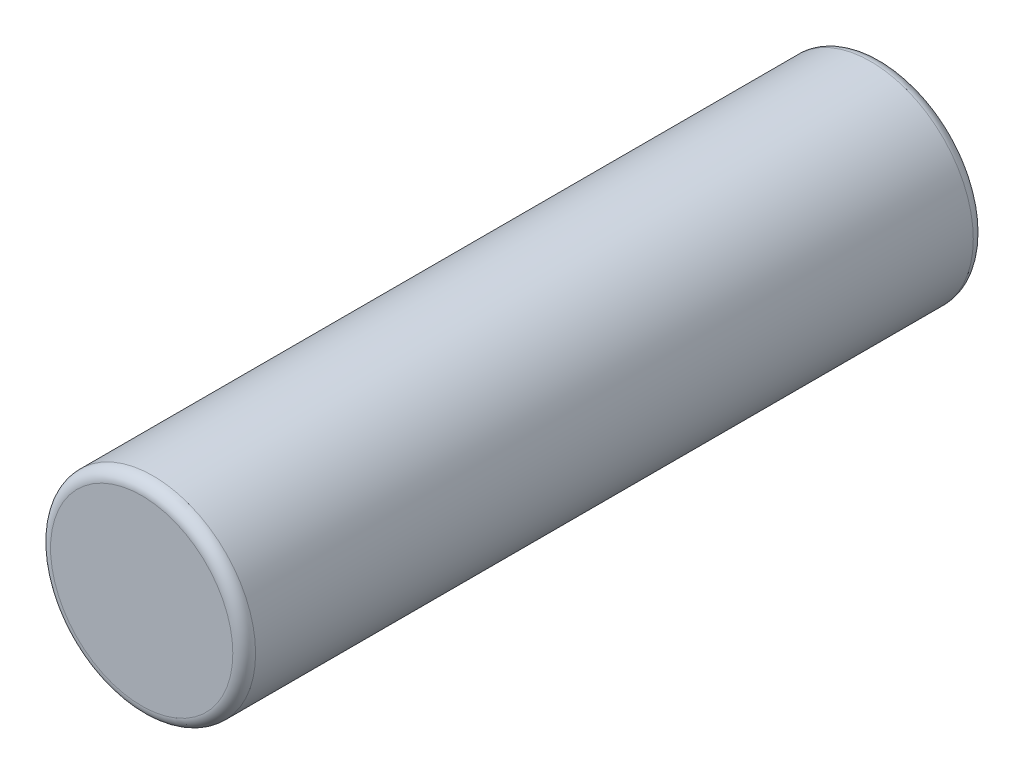
ISO-10303-21;
HEADER;
FILE_DESCRIPTION(('STEP AP214'),'2;1');
FILE_NAME('part.step','',(''),(''),'','','');
FILE_SCHEMA(('AUTOMOTIVE_DESIGN { 1 0 10303 214 1 1 1 1 }'));
ENDSEC;
DATA;
#1=APPLICATION_CONTEXT('core data for automotive mechanical design processes');
#2=APPLICATION_PROTOCOL_DEFINITION('international standard','automotive_design',2000,#1);
#3=PRODUCT_CONTEXT('',#1,'mechanical');
#4=PRODUCT('Part','Part','',(#3));
#5=PRODUCT_RELATED_PRODUCT_CATEGORY('part','',(#4));
#6=PRODUCT_DEFINITION_FORMATION('','',#4);
#7=PRODUCT_DEFINITION_CONTEXT('part definition',#1,'design');
#8=PRODUCT_DEFINITION('design','',#6,#7);
#9=PRODUCT_DEFINITION_SHAPE('','',#8);
#10=(LENGTH_UNIT() NAMED_UNIT(*) SI_UNIT(.MILLI.,.METRE.));
#11=(NAMED_UNIT(*) PLANE_ANGLE_UNIT() SI_UNIT($,.RADIAN.));
#12=(NAMED_UNIT(*) SI_UNIT($,.STERADIAN.) SOLID_ANGLE_UNIT());
#13=UNCERTAINTY_MEASURE_WITH_UNIT(LENGTH_MEASURE(1.E-05),#10,'distance_accuracy_value','');
#14=(GEOMETRIC_REPRESENTATION_CONTEXT(3) GLOBAL_UNCERTAINTY_ASSIGNED_CONTEXT((#13)) GLOBAL_UNIT_ASSIGNED_CONTEXT((#10,
#11,#12)) REPRESENTATION_CONTEXT('',''));
#15=CARTESIAN_POINT('',(0.,0.,0.));
#16=DIRECTION('',(0.,0.,1.));
#17=DIRECTION('',(1.,0.,0.));
#18=AXIS2_PLACEMENT_3D('',#15,#16,#17);
#19=CARTESIAN_POINT('',(0.,0.,65.));
#20=DIRECTION('',(0.,0.,-1.));
#21=DIRECTION('',(-1.,0.,0.));
#22=AXIS2_PLACEMENT_3D('',#19,#20,#21);
#23=CYLINDRICAL_SURFACE('',#22,9.);
#24=CARTESIAN_POINT('',(0.,0.,64.));
#25=DIRECTION('',(0.,0.,1.));
#26=DIRECTION('',(1.,0.,0.));
#27=AXIS2_PLACEMENT_3D('',#24,#25,#26);
#28=CIRCLE('',#27,9.);
#29=CARTESIAN_POINT('',(9.,0.,64.));
#30=VERTEX_POINT('',#29);
#31=EDGE_CURVE('E45',#30,#30,#28,.F.);
#32=ORIENTED_EDGE('',*,*,#31,.T.);
#33=EDGE_LOOP('',(#32));
#34=FACE_BOUND('',#33,.T.);
#35=CARTESIAN_POINT('',(0.,0.,1.));
#36=DIRECTION('',(0.,0.,1.));
#37=DIRECTION('',(1.,0.,0.));
#38=AXIS2_PLACEMENT_3D('',#35,#36,#37);
#39=CIRCLE('',#38,9.);
#40=CARTESIAN_POINT('',(9.,0.,1.));
#41=VERTEX_POINT('',#40);
#42=EDGE_CURVE('E50',#41,#41,#39,.T.);
#43=ORIENTED_EDGE('',*,*,#42,.T.);
#44=EDGE_LOOP('',(#43));
#45=FACE_BOUND('',#44,.T.);
#46=ADVANCED_FACE('F37',(#34,#45),#23,.T.);
#47=CARTESIAN_POINT('',(0.,0.,65.));
#48=DIRECTION('',(0.,0.,1.));
#49=DIRECTION('',(1.,0.,0.));
#50=AXIS2_PLACEMENT_3D('',#47,#48,#49);
#51=PLANE('',#50);
#52=CARTESIAN_POINT('',(0.,0.,65.));
#53=DIRECTION('',(0.,0.,1.));
#54=DIRECTION('',(1.,0.,0.));
#55=AXIS2_PLACEMENT_3D('',#52,#53,#54);
#56=CIRCLE('',#55,8.);
#57=CARTESIAN_POINT('',(8.,0.,65.));
#58=VERTEX_POINT('',#57);
#59=EDGE_CURVE('E55',#58,#58,#56,.T.);
#60=ORIENTED_EDGE('',*,*,#59,.T.);
#61=EDGE_LOOP('',(#60));
#62=FACE_BOUND('',#61,.T.);
#63=ADVANCED_FACE('F62',(#62),#51,.T.);
#64=CARTESIAN_POINT('',(0.,0.,0.));
#65=DIRECTION('',(0.,0.,1.));
#66=DIRECTION('',(1.,0.,0.));
#67=AXIS2_PLACEMENT_3D('',#64,#65,#66);
#68=PLANE('',#67);
#69=CARTESIAN_POINT('',(0.,0.,0.));
#70=DIRECTION('',(0.,0.,1.));
#71=DIRECTION('',(1.,0.,0.));
#72=AXIS2_PLACEMENT_3D('',#69,#70,#71);
#73=CIRCLE('',#72,8.);
#74=CARTESIAN_POINT('',(8.,0.,0.));
#75=VERTEX_POINT('',#74);
#76=EDGE_CURVE('E10',#75,#75,#73,.F.);
#77=ORIENTED_EDGE('',*,*,#76,.T.);
#78=EDGE_LOOP('',(#77));
#79=FACE_BOUND('',#78,.T.);
#80=ADVANCED_FACE('F66',(#79),#68,.F.);
#81=CARTESIAN_POINT('',(0.,0.,64.));
#82=DIRECTION('',(0.,0.,1.));
#83=DIRECTION('',(1.,0.,0.));
#84=AXIS2_PLACEMENT_3D('',#81,#82,#83);
#85=TOROIDAL_SURFACE('',#84,8.,1.);
#86=ORIENTED_EDGE('',*,*,#31,.F.);
#87=EDGE_LOOP('',(#86));
#88=FACE_BOUND('',#87,.T.);
#89=ORIENTED_EDGE('',*,*,#59,.F.);
#90=EDGE_LOOP('',(#89));
#91=FACE_BOUND('',#90,.T.);
#92=ADVANCED_FACE('F64',(#88,#91),#85,.T.);
#93=CARTESIAN_POINT('',(0.,0.,1.));
#94=DIRECTION('',(0.,0.,1.));
#95=DIRECTION('',(1.,0.,0.));
#96=AXIS2_PLACEMENT_3D('',#93,#94,#95);
#97=TOROIDAL_SURFACE('',#96,8.,1.);
#98=ORIENTED_EDGE('',*,*,#76,.F.);
#99=EDGE_LOOP('',(#98));
#100=FACE_BOUND('',#99,.T.);
#101=ORIENTED_EDGE('',*,*,#42,.F.);
#102=EDGE_LOOP('',(#101));
#103=FACE_BOUND('',#102,.T.);
#104=ADVANCED_FACE('F39',(#100,#103),#97,.T.);
#105=CLOSED_SHELL('',(#46,#63,#80,#92,#104));
#106=MANIFOLD_SOLID_BREP('B2',#105);
#107=ADVANCED_BREP_SHAPE_REPRESENTATION('',(#18,#106),#14);
#108=SHAPE_DEFINITION_REPRESENTATION(#9,#107);
ENDSEC;
END-ISO-10303-21;
